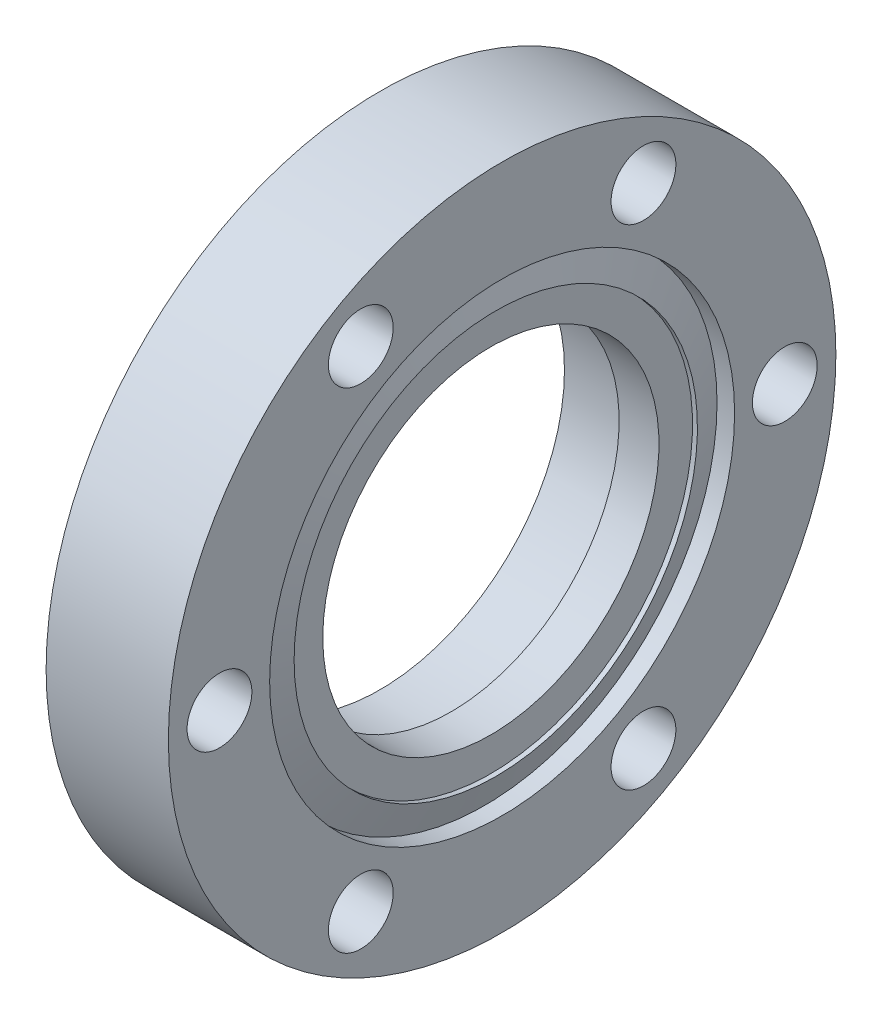
ISO-10303-21;
HEADER;
FILE_DESCRIPTION(('STEP AP214'),'2;1');
FILE_NAME('part.step','',(''),(''),'','','');
FILE_SCHEMA(('AUTOMOTIVE_DESIGN { 1 0 10303 214 1 1 1 1 }'));
ENDSEC;
DATA;
#1=APPLICATION_CONTEXT('core data for automotive mechanical design processes');
#2=APPLICATION_PROTOCOL_DEFINITION('international standard','automotive_design',2000,#1);
#3=PRODUCT_CONTEXT('',#1,'mechanical');
#4=PRODUCT('Part','Part','',(#3));
#5=PRODUCT_RELATED_PRODUCT_CATEGORY('part','',(#4));
#6=PRODUCT_DEFINITION_FORMATION('','',#4);
#7=PRODUCT_DEFINITION_CONTEXT('part definition',#1,'design');
#8=PRODUCT_DEFINITION('design','',#6,#7);
#9=PRODUCT_DEFINITION_SHAPE('','',#8);
#10=(LENGTH_UNIT() NAMED_UNIT(*) SI_UNIT(.MILLI.,.METRE.));
#11=(NAMED_UNIT(*) PLANE_ANGLE_UNIT() SI_UNIT($,.RADIAN.));
#12=(NAMED_UNIT(*) SI_UNIT($,.STERADIAN.) SOLID_ANGLE_UNIT());
#13=UNCERTAINTY_MEASURE_WITH_UNIT(LENGTH_MEASURE(1.E-05),#10,'distance_accuracy_value','');
#14=(GEOMETRIC_REPRESENTATION_CONTEXT(3) GLOBAL_UNCERTAINTY_ASSIGNED_CONTEXT((#13)) GLOBAL_UNIT_ASSIGNED_CONTEXT((#10,
#11,#12)) REPRESENTATION_CONTEXT('',''));
#15=CARTESIAN_POINT('',(0.,0.,0.));
#16=DIRECTION('',(0.,0.,1.));
#17=DIRECTION('',(1.,0.,0.));
#18=AXIS2_PLACEMENT_3D('',#15,#16,#17);
#19=CARTESIAN_POINT('',(5.18000000000051,-19.2062500000005,0.));
#20=DIRECTION('',(1.,0.,0.));
#21=DIRECTION('',(0.,0.,-1.));
#22=AXIS2_PLACEMENT_3D('',#19,#20,#21);
#23=PLANE('',#22);
#24=CARTESIAN_POINT('',(5.18000000000051,0.,0.));
#25=DIRECTION('',(-1.,0.,0.));
#26=DIRECTION('',(0.,0.,1.));
#27=AXIS2_PLACEMENT_3D('',#24,#25,#26);
#28=CIRCLE('',#27,17.4625);
#29=CARTESIAN_POINT('',(5.18000000000051,0.,17.4625));
#30=VERTEX_POINT('',#29);
#31=EDGE_CURVE('E19',#30,#30,#28,.T.);
#32=ORIENTED_EDGE('',*,*,#31,.T.);
#33=EDGE_LOOP('',(#32));
#34=FACE_BOUND('',#33,.T.);
#35=CARTESIAN_POINT('',(5.18000000000051,0.,0.));
#36=DIRECTION('',(-1.,0.,0.));
#37=DIRECTION('',(0.,0.,1.));
#38=AXIS2_PLACEMENT_3D('',#35,#36,#37);
#39=CIRCLE('',#38,20.950000000001);
#40=CARTESIAN_POINT('',(5.18000000000051,0.,20.950000000001));
#41=VERTEX_POINT('',#40);
#42=EDGE_CURVE('E82',#41,#41,#39,.F.);
#43=ORIENTED_EDGE('',*,*,#42,.T.);
#44=EDGE_LOOP('',(#43));
#45=FACE_BOUND('',#44,.T.);
#46=ADVANCED_FACE('F15',(#34,#45),#23,.T.);
#47=CARTESIAN_POINT('',(3.11069999999995,0.,0.));
#48=DIRECTION('',(-1.,0.,0.));
#49=DIRECTION('',(0.,0.,1.));
#50=AXIS2_PLACEMENT_3D('',#47,#48,#49);
#51=CYLINDRICAL_SURFACE('',#50,17.4625);
#52=CARTESIAN_POINT('',(1.04139999999939,0.,0.));
#53=DIRECTION('',(-1.,0.,0.));
#54=DIRECTION('',(0.,0.,1.));
#55=AXIS2_PLACEMENT_3D('',#52,#53,#54);
#56=CIRCLE('',#55,17.4625);
#57=CARTESIAN_POINT('',(1.04139999999939,0.,17.4625));
#58=VERTEX_POINT('',#57);
#59=EDGE_CURVE('E80',#58,#58,#56,.F.);
#60=ORIENTED_EDGE('',*,*,#59,.F.);
#61=EDGE_LOOP('',(#60));
#62=FACE_BOUND('',#61,.T.);
#63=ORIENTED_EDGE('',*,*,#31,.F.);
#64=EDGE_LOOP('',(#63));
#65=FACE_BOUND('',#64,.T.);
#66=ADVANCED_FACE('F90',(#62,#65),#51,.F.);
#67=CARTESIAN_POINT('',(5.43499999999988,0.,0.));
#68=DIRECTION('',(-1.,0.,0.));
#69=DIRECTION('',(0.,0.,1.));
#70=AXIS2_PLACEMENT_3D('',#67,#68,#69);
#71=CYLINDRICAL_SURFACE('',#70,20.950000000001);
#72=ORIENTED_EDGE('',*,*,#42,.F.);
#73=EDGE_LOOP('',(#72));
#74=FACE_BOUND('',#73,.T.);
#75=CARTESIAN_POINT('',(5.69000000223288,0.,0.));
#76=DIRECTION('',(-1.,0.,0.));
#77=DIRECTION('',(0.,-1.,0.));
#78=AXIS2_PLACEMENT_3D('',#75,#76,#77);
#79=CIRCLE('',#78,20.950000000814);
#80=CARTESIAN_POINT('',(5.69000000223288,-20.950000000814,0.));
#81=VERTEX_POINT('',#80);
#82=EDGE_CURVE('E79',#81,#81,#79,.T.);
#83=ORIENTED_EDGE('',*,*,#82,.F.);
#84=EDGE_LOOP('',(#83));
#85=FACE_BOUND('',#84,.T.);
#86=ADVANCED_FACE('F92',(#74,#85),#71,.F.);
#87=CARTESIAN_POINT('',(1.04139999999939,-18.3197499999999,0.));
#88=DIRECTION('',(-1.,0.,0.));
#89=DIRECTION('',(0.,0.,1.));
#90=AXIS2_PLACEMENT_3D('',#87,#88,#89);
#91=PLANE('',#90);
#92=ORIENTED_EDGE('',*,*,#59,.T.);
#93=EDGE_LOOP('',(#92));
#94=FACE_BOUND('',#93,.T.);
#95=CARTESIAN_POINT('',(1.04139999999939,0.,0.));
#96=DIRECTION('',(-1.,0.,0.));
#97=DIRECTION('',(0.,0.,1.));
#98=AXIS2_PLACEMENT_3D('',#95,#96,#97);
#99=CIRCLE('',#98,19.1769999999999);
#100=CARTESIAN_POINT('',(1.04139999999939,0.,19.1769999999999));
#101=VERTEX_POINT('',#100);
#102=EDGE_CURVE('E76',#101,#101,#99,.T.);
#103=ORIENTED_EDGE('',*,*,#102,.T.);
#104=EDGE_LOOP('',(#103));
#105=FACE_BOUND('',#104,.T.);
#106=ADVANCED_FACE('F100',(#94,#105),#91,.T.);
#107=CARTESIAN_POINT('',(4.52529524811392,0.,0.));
#108=DIRECTION('',(-1.,0.,0.));
#109=DIRECTION('',(0.,0.,1.));
#110=AXIS2_PLACEMENT_3D('',#107,#108,#109);
#111=CONICAL_SURFACE('',#110,24.1499999991873,1.22173047499998);
#112=ORIENTED_EDGE('',*,*,#82,.T.);
#113=EDGE_LOOP('',(#112));
#114=FACE_BOUND('',#113,.T.);
#115=CARTESIAN_POINT('',(4.52529525034756,0.,0.));
#116=DIRECTION('',(-1.,0.,0.));
#117=DIRECTION('',(0.,0.,1.));
#118=AXIS2_PLACEMENT_3D('',#115,#116,#117);
#119=CIRCLE('',#118,24.1500000000003);
#120=CARTESIAN_POINT('',(4.52529525034756,0.,24.1500000000003));
#121=VERTEX_POINT('',#120);
#122=EDGE_CURVE('E75',#121,#121,#119,.F.);
#123=ORIENTED_EDGE('',*,*,#122,.T.);
#124=EDGE_LOOP('',(#123));
#125=FACE_BOUND('',#124,.T.);
#126=ADVANCED_FACE('F128',(#114,#125),#111,.T.);
#127=CARTESIAN_POINT('',(-2.65429999999995,0.,0.));
#128=DIRECTION('',(-1.,0.,0.));
#129=DIRECTION('',(0.,0.,1.));
#130=AXIS2_PLACEMENT_3D('',#127,#128,#129);
#131=CYLINDRICAL_SURFACE('',#130,19.1769999999999);
#132=CARTESIAN_POINT('',(-6.34999999999929,0.,0.));
#133=DIRECTION('',(-1.,0.,0.));
#134=DIRECTION('',(0.,0.,1.));
#135=AXIS2_PLACEMENT_3D('',#132,#133,#134);
#136=CIRCLE('',#135,19.1769999999999);
#137=CARTESIAN_POINT('',(-6.34999999999929,0.,19.1769999999999));
#138=VERTEX_POINT('',#137);
#139=EDGE_CURVE('E54',#138,#138,#136,.F.);
#140=ORIENTED_EDGE('',*,*,#139,.F.);
#141=EDGE_LOOP('',(#140));
#142=FACE_BOUND('',#141,.T.);
#143=ORIENTED_EDGE('',*,*,#102,.F.);
#144=EDGE_LOOP('',(#143));
#145=FACE_BOUND('',#144,.T.);
#146=ADVANCED_FACE('F124',(#142,#145),#131,.F.);
#147=CARTESIAN_POINT('',(6.34999999999939,-25.4285843160799,14.6811999999998));
#148=DIRECTION('',(-1.,0.,0.));
#149=DIRECTION('',(0.,0.,1.));
#150=AXIS2_PLACEMENT_3D('',#147,#148,#149);
#151=CYLINDRICAL_SURFACE('',#150,3.36550000000002);
#152=CARTESIAN_POINT('',(6.34999999999937,-25.4285843160799,14.6811999999998));
#153=DIRECTION('',(-1.,0.,0.));
#154=DIRECTION('',(0.,0.,1.));
#155=AXIS2_PLACEMENT_3D('',#152,#153,#154);
#156=CIRCLE('',#155,3.36550000000002);
#157=CARTESIAN_POINT('',(6.34999999999937,-25.4285843160799,18.0466999999999));
#158=VERTEX_POINT('',#157);
#159=EDGE_CURVE('E51',#158,#158,#156,.T.);
#160=ORIENTED_EDGE('',*,*,#159,.F.);
#161=EDGE_LOOP('',(#160));
#162=FACE_BOUND('',#161,.T.);
#163=CARTESIAN_POINT('',(-6.34999999999929,-25.4285843160799,14.6811999999998));
#164=DIRECTION('',(-1.,0.,0.));
#165=DIRECTION('',(0.,0.,1.));
#166=AXIS2_PLACEMENT_3D('',#163,#164,#165);
#167=CIRCLE('',#166,3.36550000000002);
#168=CARTESIAN_POINT('',(-6.34999999999929,-25.4285843160799,18.0466999999999));
#169=VERTEX_POINT('',#168);
#170=EDGE_CURVE('E72',#169,#169,#167,.F.);
#171=ORIENTED_EDGE('',*,*,#170,.F.);
#172=EDGE_LOOP('',(#171));
#173=FACE_BOUND('',#172,.T.);
#174=ADVANCED_FACE('F127',(#162,#173),#151,.F.);
#175=CARTESIAN_POINT('',(6.34999999999939,0.,29.3623999999996));
#176=DIRECTION('',(-1.,0.,0.));
#177=DIRECTION('',(0.,0.,1.));
#178=AXIS2_PLACEMENT_3D('',#175,#176,#177);
#179=CYLINDRICAL_SURFACE('',#178,3.3655);
#180=CARTESIAN_POINT('',(6.34999999999937,0.,29.3623999999996));
#181=DIRECTION('',(-1.,0.,0.));
#182=DIRECTION('',(0.,0.,1.));
#183=AXIS2_PLACEMENT_3D('',#180,#181,#182);
#184=CIRCLE('',#183,3.3655);
#185=CARTESIAN_POINT('',(6.34999999999937,0.,32.7278999999996));
#186=VERTEX_POINT('',#185);
#187=EDGE_CURVE('E48',#186,#186,#184,.T.);
#188=ORIENTED_EDGE('',*,*,#187,.F.);
#189=EDGE_LOOP('',(#188));
#190=FACE_BOUND('',#189,.T.);
#191=CARTESIAN_POINT('',(-6.34999999999929,0.,29.3623999999996));
#192=DIRECTION('',(-1.,0.,0.));
#193=DIRECTION('',(0.,0.,1.));
#194=AXIS2_PLACEMENT_3D('',#191,#192,#193);
#195=CIRCLE('',#194,3.3655);
#196=CARTESIAN_POINT('',(-6.34999999999929,0.,32.7278999999996));
#197=VERTEX_POINT('',#196);
#198=EDGE_CURVE('E69',#197,#197,#195,.F.);
#199=ORIENTED_EDGE('',*,*,#198,.F.);
#200=EDGE_LOOP('',(#199));
#201=FACE_BOUND('',#200,.T.);
#202=ADVANCED_FACE('F158',(#190,#201),#179,.F.);
#203=CARTESIAN_POINT('',(6.34999999999939,25.4285843160799,14.6811999999998));
#204=DIRECTION('',(-1.,0.,0.));
#205=DIRECTION('',(0.,0.,1.));
#206=AXIS2_PLACEMENT_3D('',#203,#204,#205);
#207=CYLINDRICAL_SURFACE('',#206,3.36549999999999);
#208=CARTESIAN_POINT('',(6.34999999999937,25.4285843160799,14.6811999999998));
#209=DIRECTION('',(-1.,0.,0.));
#210=DIRECTION('',(0.,0.,1.));
#211=AXIS2_PLACEMENT_3D('',#208,#209,#210);
#212=CIRCLE('',#211,3.36549999999999);
#213=CARTESIAN_POINT('',(6.34999999999937,25.4285843160799,18.0466999999998));
#214=VERTEX_POINT('',#213);
#215=EDGE_CURVE('E45',#214,#214,#212,.T.);
#216=ORIENTED_EDGE('',*,*,#215,.F.);
#217=EDGE_LOOP('',(#216));
#218=FACE_BOUND('',#217,.T.);
#219=CARTESIAN_POINT('',(-6.34999999999929,25.4285843160799,14.6811999999998));
#220=DIRECTION('',(-1.,0.,0.));
#221=DIRECTION('',(0.,0.,1.));
#222=AXIS2_PLACEMENT_3D('',#219,#220,#221);
#223=CIRCLE('',#222,3.36549999999999);
#224=CARTESIAN_POINT('',(-6.34999999999929,25.4285843160799,18.0466999999998));
#225=VERTEX_POINT('',#224);
#226=EDGE_CURVE('E66',#225,#225,#223,.F.);
#227=ORIENTED_EDGE('',*,*,#226,.F.);
#228=EDGE_LOOP('',(#227));
#229=FACE_BOUND('',#228,.T.);
#230=ADVANCED_FACE('F166',(#218,#229),#207,.F.);
#231=CARTESIAN_POINT('',(6.34999999999939,25.4285843160799,-14.6811999999998));
#232=DIRECTION('',(-1.,0.,0.));
#233=DIRECTION('',(0.,0.,1.));
#234=AXIS2_PLACEMENT_3D('',#231,#232,#233);
#235=CYLINDRICAL_SURFACE('',#234,3.3655);
#236=CARTESIAN_POINT('',(6.34999999999937,25.4285843160799,-14.6811999999998));
#237=DIRECTION('',(-1.,0.,0.));
#238=DIRECTION('',(0.,0.,1.));
#239=AXIS2_PLACEMENT_3D('',#236,#237,#238);
#240=CIRCLE('',#239,3.3655);
#241=CARTESIAN_POINT('',(6.34999999999937,25.4285843160799,-11.3156999999998));
#242=VERTEX_POINT('',#241);
#243=EDGE_CURVE('E42',#242,#242,#240,.T.);
#244=ORIENTED_EDGE('',*,*,#243,.F.);
#245=EDGE_LOOP('',(#244));
#246=FACE_BOUND('',#245,.T.);
#247=CARTESIAN_POINT('',(-6.34999999999929,25.4285843160799,-14.6811999999998));
#248=DIRECTION('',(-1.,0.,0.));
#249=DIRECTION('',(0.,0.,1.));
#250=AXIS2_PLACEMENT_3D('',#247,#248,#249);
#251=CIRCLE('',#250,3.3655);
#252=CARTESIAN_POINT('',(-6.34999999999929,25.4285843160799,-11.3156999999998));
#253=VERTEX_POINT('',#252);
#254=EDGE_CURVE('E63',#253,#253,#251,.F.);
#255=ORIENTED_EDGE('',*,*,#254,.F.);
#256=EDGE_LOOP('',(#255));
#257=FACE_BOUND('',#256,.T.);
#258=ADVANCED_FACE('F174',(#246,#257),#235,.F.);
#259=CARTESIAN_POINT('',(6.34999999999939,-25.4285843160799,-14.6811999999998));
#260=DIRECTION('',(-1.,0.,0.));
#261=DIRECTION('',(0.,0.,1.));
#262=AXIS2_PLACEMENT_3D('',#259,#260,#261);
#263=CYLINDRICAL_SURFACE('',#262,3.3655);
#264=CARTESIAN_POINT('',(6.34999999999937,-25.4285843160799,-14.6811999999998));
#265=DIRECTION('',(-1.,0.,0.));
#266=DIRECTION('',(0.,0.,1.));
#267=AXIS2_PLACEMENT_3D('',#264,#265,#266);
#268=CIRCLE('',#267,3.3655);
#269=CARTESIAN_POINT('',(6.34999999999937,-25.4285843160799,-11.3156999999998));
#270=VERTEX_POINT('',#269);
#271=EDGE_CURVE('E39',#270,#270,#268,.T.);
#272=ORIENTED_EDGE('',*,*,#271,.F.);
#273=EDGE_LOOP('',(#272));
#274=FACE_BOUND('',#273,.T.);
#275=CARTESIAN_POINT('',(-6.34999999999929,-25.4285843160799,-14.6811999999998));
#276=DIRECTION('',(-1.,0.,0.));
#277=DIRECTION('',(0.,0.,1.));
#278=AXIS2_PLACEMENT_3D('',#275,#276,#277);
#279=CIRCLE('',#278,3.3655);
#280=CARTESIAN_POINT('',(-6.34999999999929,-25.4285843160799,-11.3156999999998));
#281=VERTEX_POINT('',#280);
#282=EDGE_CURVE('E60',#281,#281,#279,.F.);
#283=ORIENTED_EDGE('',*,*,#282,.F.);
#284=EDGE_LOOP('',(#283));
#285=FACE_BOUND('',#284,.T.);
#286=ADVANCED_FACE('F182',(#274,#285),#263,.F.);
#287=CARTESIAN_POINT('',(6.34999999999939,0.,-29.3623999999996));
#288=DIRECTION('',(-1.,0.,0.));
#289=DIRECTION('',(0.,0.,1.));
#290=AXIS2_PLACEMENT_3D('',#287,#288,#289);
#291=CYLINDRICAL_SURFACE('',#290,3.3655);
#292=CARTESIAN_POINT('',(6.34999999999937,0.,-29.3623999999996));
#293=DIRECTION('',(-1.,0.,0.));
#294=DIRECTION('',(0.,0.,1.));
#295=AXIS2_PLACEMENT_3D('',#292,#293,#294);
#296=CIRCLE('',#295,3.3655);
#297=CARTESIAN_POINT('',(6.34999999999937,0.,-25.9968999999996));
#298=VERTEX_POINT('',#297);
#299=EDGE_CURVE('E36',#298,#298,#296,.T.);
#300=ORIENTED_EDGE('',*,*,#299,.F.);
#301=EDGE_LOOP('',(#300));
#302=FACE_BOUND('',#301,.T.);
#303=CARTESIAN_POINT('',(-6.34999999999929,0.,-29.3623999999996));
#304=DIRECTION('',(-1.,0.,0.));
#305=DIRECTION('',(0.,0.,1.));
#306=AXIS2_PLACEMENT_3D('',#303,#304,#305);
#307=CIRCLE('',#306,3.3655);
#308=CARTESIAN_POINT('',(-6.34999999999929,0.,-25.9968999999996));
#309=VERTEX_POINT('',#308);
#310=EDGE_CURVE('E57',#309,#309,#307,.F.);
#311=ORIENTED_EDGE('',*,*,#310,.F.);
#312=EDGE_LOOP('',(#311));
#313=FACE_BOUND('',#312,.T.);
#314=ADVANCED_FACE('F17',(#302,#313),#291,.F.);
#315=CARTESIAN_POINT('',(5.43764762517347,0.,0.));
#316=DIRECTION('',(-1.,0.,0.));
#317=DIRECTION('',(0.,0.,1.));
#318=AXIS2_PLACEMENT_3D('',#315,#316,#317);
#319=CYLINDRICAL_SURFACE('',#318,24.1500000000003);
#320=ORIENTED_EDGE('',*,*,#122,.F.);
#321=EDGE_LOOP('',(#320));
#322=FACE_BOUND('',#321,.T.);
#323=CARTESIAN_POINT('',(6.34999999999937,0.,0.));
#324=DIRECTION('',(-1.,0.,0.));
#325=DIRECTION('',(0.,0.,1.));
#326=AXIS2_PLACEMENT_3D('',#323,#324,#325);
#327=CIRCLE('',#326,24.1500000000003);
#328=CARTESIAN_POINT('',(6.34999999999937,0.,24.1500000000003));
#329=VERTEX_POINT('',#328);
#330=EDGE_CURVE('E28',#329,#329,#327,.T.);
#331=ORIENTED_EDGE('',*,*,#330,.F.);
#332=EDGE_LOOP('',(#331));
#333=FACE_BOUND('',#332,.T.);
#334=ADVANCED_FACE('F119',(#322,#333),#319,.F.);
#335=CARTESIAN_POINT('',(-6.34999999999929,-26.9240000000001,0.));
#336=DIRECTION('',(-1.,0.,0.));
#337=DIRECTION('',(0.,0.,1.));
#338=AXIS2_PLACEMENT_3D('',#335,#336,#337);
#339=PLANE('',#338);
#340=ORIENTED_EDGE('',*,*,#139,.T.);
#341=EDGE_LOOP('',(#340));
#342=FACE_BOUND('',#341,.T.);
#343=ORIENTED_EDGE('',*,*,#310,.T.);
#344=EDGE_LOOP('',(#343));
#345=FACE_BOUND('',#344,.T.);
#346=ORIENTED_EDGE('',*,*,#282,.T.);
#347=EDGE_LOOP('',(#346));
#348=FACE_BOUND('',#347,.T.);
#349=ORIENTED_EDGE('',*,*,#254,.T.);
#350=EDGE_LOOP('',(#349));
#351=FACE_BOUND('',#350,.T.);
#352=ORIENTED_EDGE('',*,*,#226,.T.);
#353=EDGE_LOOP('',(#352));
#354=FACE_BOUND('',#353,.T.);
#355=ORIENTED_EDGE('',*,*,#198,.T.);
#356=EDGE_LOOP('',(#355));
#357=FACE_BOUND('',#356,.T.);
#358=ORIENTED_EDGE('',*,*,#170,.T.);
#359=EDGE_LOOP('',(#358));
#360=FACE_BOUND('',#359,.T.);
#361=CARTESIAN_POINT('',(-6.34999999999929,0.,0.));
#362=DIRECTION('',(-1.,0.,0.));
#363=DIRECTION('',(0.,0.,1.));
#364=AXIS2_PLACEMENT_3D('',#361,#362,#363);
#365=CIRCLE('',#364,34.6710000000003);
#366=CARTESIAN_POINT('',(-6.34999999999929,0.,34.6710000000003));
#367=VERTEX_POINT('',#366);
#368=EDGE_CURVE('E23',#367,#367,#365,.F.);
#369=ORIENTED_EDGE('',*,*,#368,.F.);
#370=EDGE_LOOP('',(#369));
#371=FACE_BOUND('',#370,.T.);
#372=ADVANCED_FACE('F112',(#342,#345,#348,#351,#354,#357,#360,#371),#339,.T.);
#373=CARTESIAN_POINT('',(6.34999999999937,-29.4105000000003,0.));
#374=DIRECTION('',(1.,0.,0.));
#375=DIRECTION('',(0.,0.,-1.));
#376=AXIS2_PLACEMENT_3D('',#373,#374,#375);
#377=PLANE('',#376);
#378=ORIENTED_EDGE('',*,*,#330,.T.);
#379=EDGE_LOOP('',(#378));
#380=FACE_BOUND('',#379,.T.);
#381=ORIENTED_EDGE('',*,*,#299,.T.);
#382=EDGE_LOOP('',(#381));
#383=FACE_BOUND('',#382,.T.);
#384=ORIENTED_EDGE('',*,*,#271,.T.);
#385=EDGE_LOOP('',(#384));
#386=FACE_BOUND('',#385,.T.);
#387=ORIENTED_EDGE('',*,*,#243,.T.);
#388=EDGE_LOOP('',(#387));
#389=FACE_BOUND('',#388,.T.);
#390=ORIENTED_EDGE('',*,*,#215,.T.);
#391=EDGE_LOOP('',(#390));
#392=FACE_BOUND('',#391,.T.);
#393=ORIENTED_EDGE('',*,*,#187,.T.);
#394=EDGE_LOOP('',(#393));
#395=FACE_BOUND('',#394,.T.);
#396=ORIENTED_EDGE('',*,*,#159,.T.);
#397=EDGE_LOOP('',(#396));
#398=FACE_BOUND('',#397,.T.);
#399=CARTESIAN_POINT('',(6.34999999999937,0.,0.));
#400=DIRECTION('',(-1.,0.,0.));
#401=DIRECTION('',(0.,0.,1.));
#402=AXIS2_PLACEMENT_3D('',#399,#400,#401);
#403=CIRCLE('',#402,34.6710000000003);
#404=CARTESIAN_POINT('',(6.34999999999937,0.,34.6710000000003));
#405=VERTEX_POINT('',#404);
#406=EDGE_CURVE('E10',#405,#405,#403,.T.);
#407=ORIENTED_EDGE('',*,*,#406,.F.);
#408=EDGE_LOOP('',(#407));
#409=FACE_BOUND('',#408,.T.);
#410=ADVANCED_FACE('F107',(#380,#383,#386,#389,#392,#395,#398,#409),#377,.T.);
#411=CARTESIAN_POINT('',(0.,0.,0.));
#412=DIRECTION('',(-1.,0.,0.));
#413=DIRECTION('',(0.,0.,1.));
#414=AXIS2_PLACEMENT_3D('',#411,#412,#413);
#415=CYLINDRICAL_SURFACE('',#414,34.6710000000003);
#416=ORIENTED_EDGE('',*,*,#406,.T.);
#417=EDGE_LOOP('',(#416));
#418=FACE_BOUND('',#417,.T.);
#419=ORIENTED_EDGE('',*,*,#368,.T.);
#420=EDGE_LOOP('',(#419));
#421=FACE_BOUND('',#420,.T.);
#422=ADVANCED_FACE('F105',(#418,#421),#415,.T.);
#423=CLOSED_SHELL('',(#46,#66,#86,#106,#126,#146,#174,#202,#230,#258,#286,#314,#334,#372,#410,#422));
#424=MANIFOLD_SOLID_BREP('B1',#423);
#425=ADVANCED_BREP_SHAPE_REPRESENTATION('',(#18,#424),#14);
#426=SHAPE_DEFINITION_REPRESENTATION(#9,#425);
ENDSEC;
END-ISO-10303-21;
